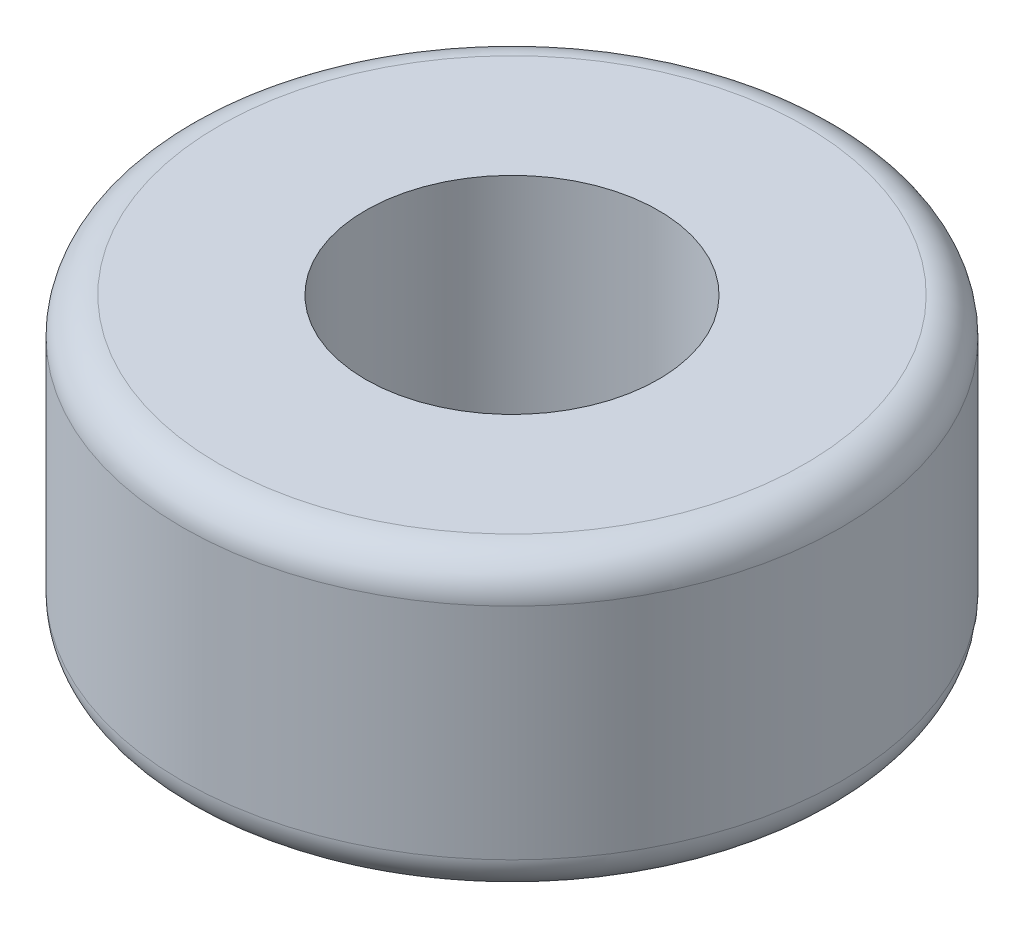
ISO-10303-21;
HEADER;
FILE_DESCRIPTION(('STEP AP214'),'2;1');
FILE_NAME('part.step','',(''),(''),'','','');
FILE_SCHEMA(('AUTOMOTIVE_DESIGN { 1 0 10303 214 1 1 1 1 }'));
ENDSEC;
DATA;
#1=APPLICATION_CONTEXT('core data for automotive mechanical design processes');
#2=APPLICATION_PROTOCOL_DEFINITION('international standard','automotive_design',2000,#1);
#3=PRODUCT_CONTEXT('',#1,'mechanical');
#4=PRODUCT('Part','Part','',(#3));
#5=PRODUCT_RELATED_PRODUCT_CATEGORY('part','',(#4));
#6=PRODUCT_DEFINITION_FORMATION('','',#4);
#7=PRODUCT_DEFINITION_CONTEXT('part definition',#1,'design');
#8=PRODUCT_DEFINITION('design','',#6,#7);
#9=PRODUCT_DEFINITION_SHAPE('','',#8);
#10=(LENGTH_UNIT() NAMED_UNIT(*) SI_UNIT(.MILLI.,.METRE.));
#11=(NAMED_UNIT(*) PLANE_ANGLE_UNIT() SI_UNIT($,.RADIAN.));
#12=(NAMED_UNIT(*) SI_UNIT($,.STERADIAN.) SOLID_ANGLE_UNIT());
#13=UNCERTAINTY_MEASURE_WITH_UNIT(LENGTH_MEASURE(1.E-05),#10,'distance_accuracy_value','');
#14=(GEOMETRIC_REPRESENTATION_CONTEXT(3) GLOBAL_UNCERTAINTY_ASSIGNED_CONTEXT((#13)) GLOBAL_UNIT_ASSIGNED_CONTEXT((#10,
#11,#12)) REPRESENTATION_CONTEXT('',''));
#15=CARTESIAN_POINT('',(0.,0.,0.));
#16=DIRECTION('',(0.,0.,1.));
#17=DIRECTION('',(1.,0.,0.));
#18=AXIS2_PLACEMENT_3D('',#15,#16,#17);
#19=CARTESIAN_POINT('',(0.,4.,0.));
#20=DIRECTION('',(0.,1.,0.));
#21=DIRECTION('',(0.,0.,1.));
#22=AXIS2_PLACEMENT_3D('',#19,#20,#21);
#23=PLANE('',#22);
#24=CARTESIAN_POINT('',(0.,4.,0.));
#25=DIRECTION('',(0.,1.,0.));
#26=DIRECTION('',(0.,0.,1.));
#27=AXIS2_PLACEMENT_3D('',#24,#25,#26);
#28=CIRCLE('',#27,4.);
#29=CARTESIAN_POINT('',(0.,4.,4.));
#30=VERTEX_POINT('',#29);
#31=EDGE_CURVE('E10',#30,#30,#28,.T.);
#32=ORIENTED_EDGE('',*,*,#31,.T.);
#33=EDGE_LOOP('',(#32));
#34=FACE_BOUND('',#33,.T.);
#35=CARTESIAN_POINT('',(0.,4.,0.));
#36=DIRECTION('',(0.,1.,0.));
#37=DIRECTION('',(0.,0.,1.));
#38=AXIS2_PLACEMENT_3D('',#35,#36,#37);
#39=CIRCLE('',#38,2.);
#40=CARTESIAN_POINT('',(0.,4.,2.));
#41=VERTEX_POINT('',#40);
#42=EDGE_CURVE('E51',#41,#41,#39,.T.);
#43=ORIENTED_EDGE('',*,*,#42,.F.);
#44=EDGE_LOOP('',(#43));
#45=FACE_BOUND('',#44,.T.);
#46=ADVANCED_FACE('F31',(#34,#45),#23,.T.);
#47=CARTESIAN_POINT('',(0.,0.,0.));
#48=DIRECTION('',(0.,1.,0.));
#49=DIRECTION('',(0.,0.,1.));
#50=AXIS2_PLACEMENT_3D('',#47,#48,#49);
#51=PLANE('',#50);
#52=CARTESIAN_POINT('',(0.,0.,0.));
#53=DIRECTION('',(0.,1.,0.));
#54=DIRECTION('',(0.,0.,1.));
#55=AXIS2_PLACEMENT_3D('',#52,#53,#54);
#56=CIRCLE('',#55,4.);
#57=CARTESIAN_POINT('',(0.,0.,4.));
#58=VERTEX_POINT('',#57);
#59=EDGE_CURVE('E38',#58,#58,#56,.F.);
#60=ORIENTED_EDGE('',*,*,#59,.T.);
#61=EDGE_LOOP('',(#60));
#62=FACE_BOUND('',#61,.T.);
#63=CARTESIAN_POINT('',(0.,0.,0.));
#64=DIRECTION('',(0.,1.,0.));
#65=DIRECTION('',(0.,0.,1.));
#66=AXIS2_PLACEMENT_3D('',#63,#64,#65);
#67=CIRCLE('',#66,2.);
#68=CARTESIAN_POINT('',(0.,0.,2.));
#69=VERTEX_POINT('',#68);
#70=EDGE_CURVE('E52',#69,#69,#67,.T.);
#71=ORIENTED_EDGE('',*,*,#70,.T.);
#72=EDGE_LOOP('',(#71));
#73=FACE_BOUND('',#72,.T.);
#74=ADVANCED_FACE('F62',(#62,#73),#51,.F.);
#75=CARTESIAN_POINT('',(0.,4.,0.));
#76=DIRECTION('',(0.,-1.,0.));
#77=DIRECTION('',(0.,0.,-1.));
#78=AXIS2_PLACEMENT_3D('',#75,#76,#77);
#79=CYLINDRICAL_SURFACE('',#78,4.5);
#80=CARTESIAN_POINT('',(0.,0.5,0.));
#81=DIRECTION('',(0.,1.,0.));
#82=DIRECTION('',(0.,0.,1.));
#83=AXIS2_PLACEMENT_3D('',#80,#81,#82);
#84=CIRCLE('',#83,4.5);
#85=CARTESIAN_POINT('',(0.,0.5,4.5));
#86=VERTEX_POINT('',#85);
#87=EDGE_CURVE('E42',#86,#86,#84,.T.);
#88=ORIENTED_EDGE('',*,*,#87,.T.);
#89=EDGE_LOOP('',(#88));
#90=FACE_BOUND('',#89,.T.);
#91=CARTESIAN_POINT('',(0.,3.5,0.));
#92=DIRECTION('',(0.,1.,0.));
#93=DIRECTION('',(0.,0.,1.));
#94=AXIS2_PLACEMENT_3D('',#91,#92,#93);
#95=CIRCLE('',#94,4.5);
#96=CARTESIAN_POINT('',(0.,3.5,4.5));
#97=VERTEX_POINT('',#96);
#98=EDGE_CURVE('E46',#97,#97,#95,.F.);
#99=ORIENTED_EDGE('',*,*,#98,.T.);
#100=EDGE_LOOP('',(#99));
#101=FACE_BOUND('',#100,.T.);
#102=ADVANCED_FACE('F67',(#90,#101),#79,.T.);
#103=CARTESIAN_POINT('',(0.,4.,0.));
#104=DIRECTION('',(0.,-1.,0.));
#105=DIRECTION('',(0.,0.,-1.));
#106=AXIS2_PLACEMENT_3D('',#103,#104,#105);
#107=CYLINDRICAL_SURFACE('',#106,2.);
#108=ORIENTED_EDGE('',*,*,#42,.T.);
#109=EDGE_LOOP('',(#108));
#110=FACE_BOUND('',#109,.T.);
#111=ORIENTED_EDGE('',*,*,#70,.F.);
#112=EDGE_LOOP('',(#111));
#113=FACE_BOUND('',#112,.T.);
#114=ADVANCED_FACE('F58',(#110,#113),#107,.F.);
#115=CARTESIAN_POINT('',(0.,0.5,0.));
#116=DIRECTION('',(0.,1.,0.));
#117=DIRECTION('',(0.,0.,1.));
#118=AXIS2_PLACEMENT_3D('',#115,#116,#117);
#119=TOROIDAL_SURFACE('',#118,4.,0.5);
#120=ORIENTED_EDGE('',*,*,#59,.F.);
#121=EDGE_LOOP('',(#120));
#122=FACE_BOUND('',#121,.T.);
#123=ORIENTED_EDGE('',*,*,#87,.F.);
#124=EDGE_LOOP('',(#123));
#125=FACE_BOUND('',#124,.T.);
#126=ADVANCED_FACE('F73',(#122,#125),#119,.T.);
#127=CARTESIAN_POINT('',(0.,3.5,0.));
#128=DIRECTION('',(0.,1.,0.));
#129=DIRECTION('',(0.,0.,1.));
#130=AXIS2_PLACEMENT_3D('',#127,#128,#129);
#131=TOROIDAL_SURFACE('',#130,4.,0.5);
#132=ORIENTED_EDGE('',*,*,#98,.F.);
#133=EDGE_LOOP('',(#132));
#134=FACE_BOUND('',#133,.T.);
#135=ORIENTED_EDGE('',*,*,#31,.F.);
#136=EDGE_LOOP('',(#135));
#137=FACE_BOUND('',#136,.T.);
#138=ADVANCED_FACE('F33',(#134,#137),#131,.T.);
#139=CLOSED_SHELL('',(#46,#74,#102,#114,#126,#138));
#140=MANIFOLD_SOLID_BREP('B2',#139);
#141=ADVANCED_BREP_SHAPE_REPRESENTATION('',(#18,#140),#14);
#142=SHAPE_DEFINITION_REPRESENTATION(#9,#141);
ENDSEC;
END-ISO-10303-21;
